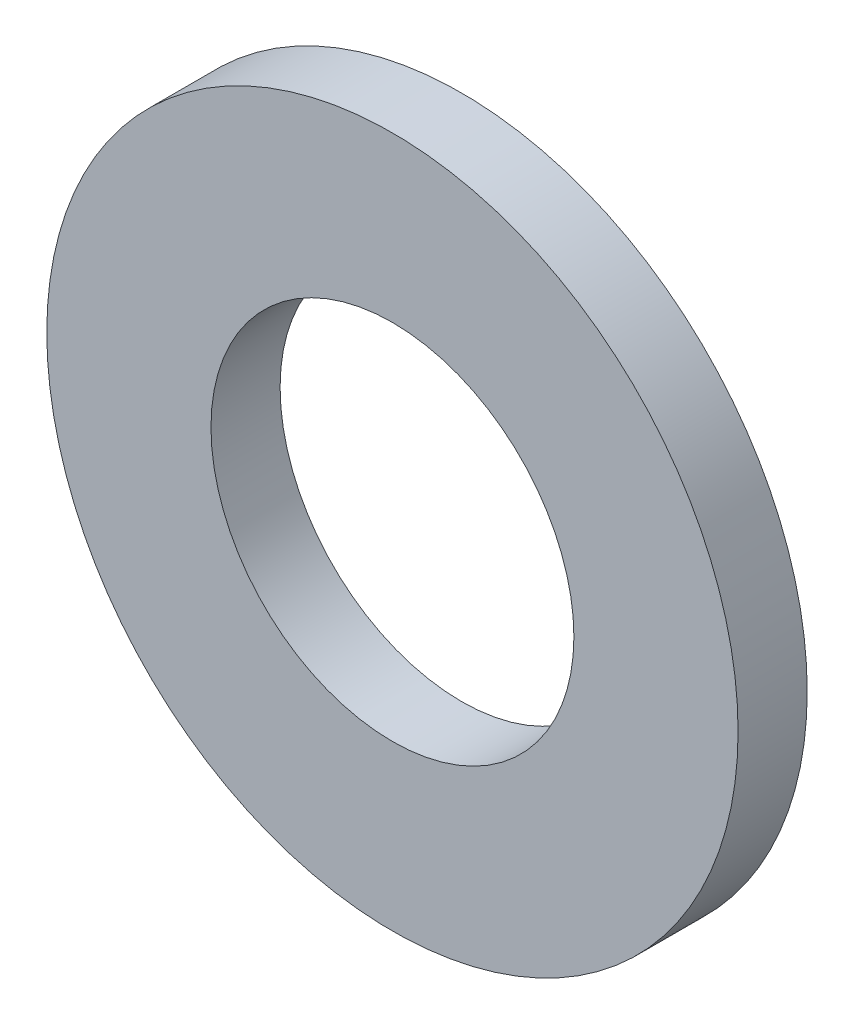
ISO-10303-21;
HEADER;
FILE_DESCRIPTION(('STEP AP214'),'2;1');
FILE_NAME('part.step','',(''),(''),'','','');
FILE_SCHEMA(('AUTOMOTIVE_DESIGN { 1 0 10303 214 1 1 1 1 }'));
ENDSEC;
DATA;
#1=APPLICATION_CONTEXT('core data for automotive mechanical design processes');
#2=APPLICATION_PROTOCOL_DEFINITION('international standard','automotive_design',2000,#1);
#3=PRODUCT_CONTEXT('',#1,'mechanical');
#4=PRODUCT('Part','Part','',(#3));
#5=PRODUCT_RELATED_PRODUCT_CATEGORY('part','',(#4));
#6=PRODUCT_DEFINITION_FORMATION('','',#4);
#7=PRODUCT_DEFINITION_CONTEXT('part definition',#1,'design');
#8=PRODUCT_DEFINITION('design','',#6,#7);
#9=PRODUCT_DEFINITION_SHAPE('','',#8);
#10=(LENGTH_UNIT() NAMED_UNIT(*) SI_UNIT(.MILLI.,.METRE.));
#11=(NAMED_UNIT(*) PLANE_ANGLE_UNIT() SI_UNIT($,.RADIAN.));
#12=(NAMED_UNIT(*) SI_UNIT($,.STERADIAN.) SOLID_ANGLE_UNIT());
#13=UNCERTAINTY_MEASURE_WITH_UNIT(LENGTH_MEASURE(1.E-05),#10,'distance_accuracy_value','');
#14=(GEOMETRIC_REPRESENTATION_CONTEXT(3) GLOBAL_UNCERTAINTY_ASSIGNED_CONTEXT((#13)) GLOBAL_UNIT_ASSIGNED_CONTEXT((#10,
#11,#12)) REPRESENTATION_CONTEXT('',''));
#15=CARTESIAN_POINT('',(0.,0.,0.));
#16=DIRECTION('',(0.,0.,1.));
#17=DIRECTION('',(1.,0.,0.));
#18=AXIS2_PLACEMENT_3D('',#15,#16,#17);
#19=CARTESIAN_POINT('',(0.,0.,2.));
#20=DIRECTION('',(0.,0.,1.));
#21=DIRECTION('',(1.,0.,0.));
#22=AXIS2_PLACEMENT_3D('',#19,#20,#21);
#23=PLANE('',#22);
#24=CARTESIAN_POINT('',(0.,0.,2.));
#25=DIRECTION('',(0.,0.,1.));
#26=DIRECTION('',(1.,0.,0.));
#27=AXIS2_PLACEMENT_3D('',#24,#25,#26);
#28=CIRCLE('',#27,10.);
#29=CARTESIAN_POINT('',(10.,0.,2.));
#30=VERTEX_POINT('',#29);
#31=EDGE_CURVE('E10',#30,#30,#28,.T.);
#32=ORIENTED_EDGE('',*,*,#31,.T.);
#33=EDGE_LOOP('',(#32));
#34=FACE_BOUND('',#33,.T.);
#35=CARTESIAN_POINT('',(0.,0.,2.));
#36=DIRECTION('',(0.,0.,1.));
#37=DIRECTION('',(1.,0.,0.));
#38=AXIS2_PLACEMENT_3D('',#35,#36,#37);
#39=CIRCLE('',#38,5.25);
#40=CARTESIAN_POINT('',(5.25,0.,2.));
#41=VERTEX_POINT('',#40);
#42=EDGE_CURVE('E41',#41,#41,#39,.T.);
#43=ORIENTED_EDGE('',*,*,#42,.F.);
#44=EDGE_LOOP('',(#43));
#45=FACE_BOUND('',#44,.T.);
#46=ADVANCED_FACE('F30',(#34,#45),#23,.T.);
#47=CARTESIAN_POINT('',(0.,0.,0.));
#48=DIRECTION('',(0.,0.,1.));
#49=DIRECTION('',(1.,0.,0.));
#50=AXIS2_PLACEMENT_3D('',#47,#48,#49);
#51=PLANE('',#50);
#52=CARTESIAN_POINT('',(0.,0.,0.));
#53=DIRECTION('',(0.,0.,1.));
#54=DIRECTION('',(1.,0.,0.));
#55=AXIS2_PLACEMENT_3D('',#52,#53,#54);
#56=CIRCLE('',#55,10.);
#57=CARTESIAN_POINT('',(10.,0.,0.));
#58=VERTEX_POINT('',#57);
#59=EDGE_CURVE('E34',#58,#58,#56,.T.);
#60=ORIENTED_EDGE('',*,*,#59,.F.);
#61=EDGE_LOOP('',(#60));
#62=FACE_BOUND('',#61,.T.);
#63=CARTESIAN_POINT('',(0.,0.,0.));
#64=DIRECTION('',(0.,0.,1.));
#65=DIRECTION('',(1.,0.,0.));
#66=AXIS2_PLACEMENT_3D('',#63,#64,#65);
#67=CIRCLE('',#66,5.25);
#68=CARTESIAN_POINT('',(5.25,0.,0.));
#69=VERTEX_POINT('',#68);
#70=EDGE_CURVE('E43',#69,#69,#67,.T.);
#71=ORIENTED_EDGE('',*,*,#70,.T.);
#72=EDGE_LOOP('',(#71));
#73=FACE_BOUND('',#72,.T.);
#74=ADVANCED_FACE('F53',(#62,#73),#51,.F.);
#75=CARTESIAN_POINT('',(0.,0.,2.));
#76=DIRECTION('',(0.,0.,-1.));
#77=DIRECTION('',(-1.,0.,0.));
#78=AXIS2_PLACEMENT_3D('',#75,#76,#77);
#79=CYLINDRICAL_SURFACE('',#78,10.);
#80=ORIENTED_EDGE('',*,*,#31,.F.);
#81=EDGE_LOOP('',(#80));
#82=FACE_BOUND('',#81,.T.);
#83=ORIENTED_EDGE('',*,*,#59,.T.);
#84=EDGE_LOOP('',(#83));
#85=FACE_BOUND('',#84,.T.);
#86=ADVANCED_FACE('F32',(#82,#85),#79,.T.);
#87=CARTESIAN_POINT('',(0.,0.,2.));
#88=DIRECTION('',(0.,0.,-1.));
#89=DIRECTION('',(-1.,0.,0.));
#90=AXIS2_PLACEMENT_3D('',#87,#88,#89);
#91=CYLINDRICAL_SURFACE('',#90,5.25);
#92=ORIENTED_EDGE('',*,*,#42,.T.);
#93=EDGE_LOOP('',(#92));
#94=FACE_BOUND('',#93,.T.);
#95=ORIENTED_EDGE('',*,*,#70,.F.);
#96=EDGE_LOOP('',(#95));
#97=FACE_BOUND('',#96,.T.);
#98=ADVANCED_FACE('F49',(#94,#97),#91,.F.);
#99=CLOSED_SHELL('',(#46,#74,#86,#98));
#100=MANIFOLD_SOLID_BREP('B2',#99);
#101=ADVANCED_BREP_SHAPE_REPRESENTATION('',(#18,#100),#14);
#102=SHAPE_DEFINITION_REPRESENTATION(#9,#101);
ENDSEC;
END-ISO-10303-21;
